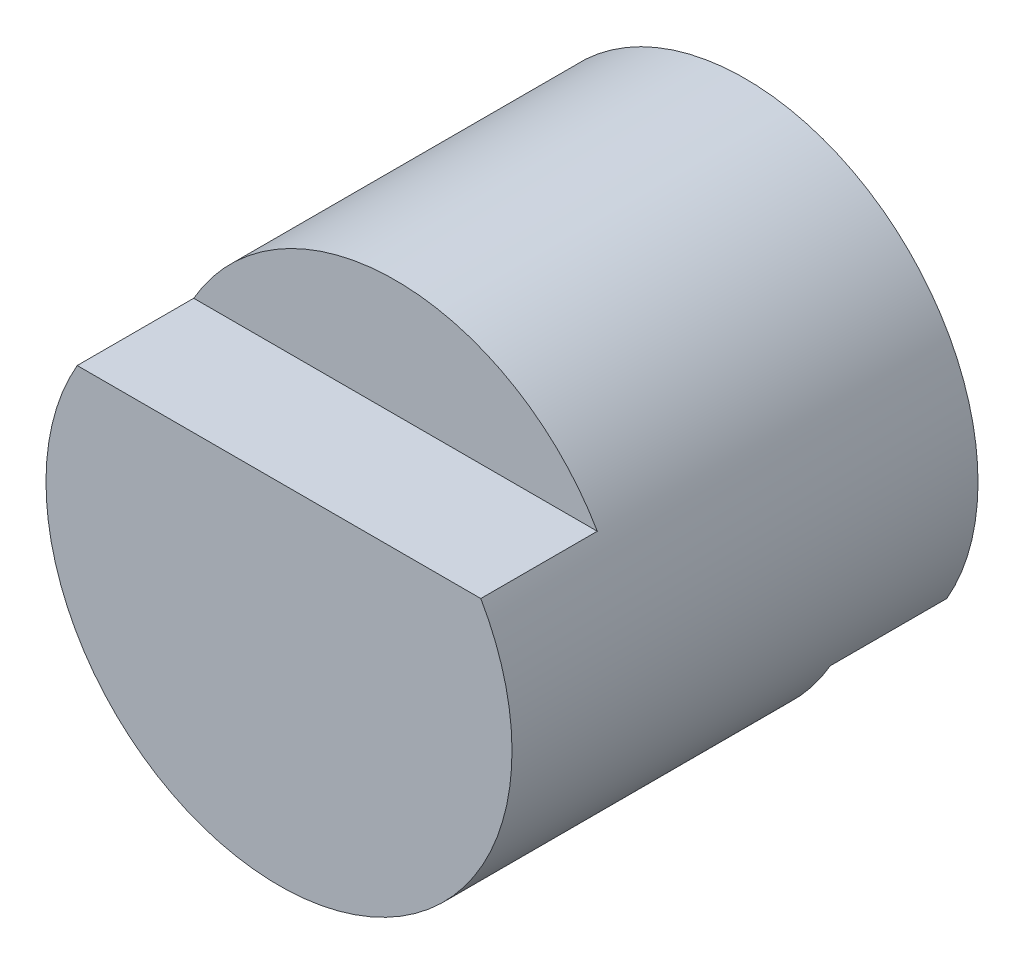
ISO-10303-21;
HEADER;
FILE_DESCRIPTION(('STEP AP214'),'2;1');
FILE_NAME('part.step','',(''),(''),'','','');
FILE_SCHEMA(('AUTOMOTIVE_DESIGN { 1 0 10303 214 1 1 1 1 }'));
ENDSEC;
DATA;
#1=APPLICATION_CONTEXT('core data for automotive mechanical design processes');
#2=APPLICATION_PROTOCOL_DEFINITION('international standard','automotive_design',2000,#1);
#3=PRODUCT_CONTEXT('',#1,'mechanical');
#4=PRODUCT('Part','Part','',(#3));
#5=PRODUCT_RELATED_PRODUCT_CATEGORY('part','',(#4));
#6=PRODUCT_DEFINITION_FORMATION('','',#4);
#7=PRODUCT_DEFINITION_CONTEXT('part definition',#1,'design');
#8=PRODUCT_DEFINITION('design','',#6,#7);
#9=PRODUCT_DEFINITION_SHAPE('','',#8);
#10=(LENGTH_UNIT() NAMED_UNIT(*) SI_UNIT(.MILLI.,.METRE.));
#11=(NAMED_UNIT(*) PLANE_ANGLE_UNIT() SI_UNIT($,.RADIAN.));
#12=(NAMED_UNIT(*) SI_UNIT($,.STERADIAN.) SOLID_ANGLE_UNIT());
#13=UNCERTAINTY_MEASURE_WITH_UNIT(LENGTH_MEASURE(1.E-05),#10,'distance_accuracy_value','');
#14=(GEOMETRIC_REPRESENTATION_CONTEXT(3) GLOBAL_UNCERTAINTY_ASSIGNED_CONTEXT((#13)) GLOBAL_UNIT_ASSIGNED_CONTEXT((#10,
#11,#12)) REPRESENTATION_CONTEXT('',''));
#15=CARTESIAN_POINT('',(0.,0.,0.));
#16=DIRECTION('',(0.,0.,1.));
#17=DIRECTION('',(1.,0.,0.));
#18=AXIS2_PLACEMENT_3D('',#15,#16,#17);
#19=CARTESIAN_POINT('',(0.,0.,4.));
#20=DIRECTION('',(0.,0.,-1.));
#21=DIRECTION('',(-1.,0.,0.));
#22=AXIS2_PLACEMENT_3D('',#19,#20,#21);
#23=CYLINDRICAL_SURFACE('',#22,2.);
#24=CARTESIAN_POINT('',(0.,0.,4.));
#25=DIRECTION('',(0.,0.,1.));
#26=DIRECTION('',(1.,0.,0.));
#27=AXIS2_PLACEMENT_3D('',#24,#25,#26);
#28=CIRCLE('',#27,2.);
#29=CARTESIAN_POINT('',(-1.73205080756888,1.,4.));
#30=VERTEX_POINT('',#29);
#31=CARTESIAN_POINT('',(1.73205080756888,1.,4.));
#32=VERTEX_POINT('',#31);
#33=EDGE_CURVE('E11',#30,#32,#28,.T.);
#34=ORIENTED_EDGE('',*,*,#33,.F.);
#35=DIRECTION('',(0.,0.,1.));
#36=VECTOR('',#35,1.);
#37=CARTESIAN_POINT('',(-1.73205080756888,1.,3.));
#38=LINE('',#37,#36);
#39=CARTESIAN_POINT('',(-1.73205080756888,1.,3.));
#40=VERTEX_POINT('',#39);
#41=EDGE_CURVE('E55',#40,#30,#38,.T.);
#42=ORIENTED_EDGE('',*,*,#41,.F.);
#43=CARTESIAN_POINT('',(0.,0.,3.));
#44=DIRECTION('',(0.,0.,1.));
#45=DIRECTION('',(-1.,0.,0.));
#46=AXIS2_PLACEMENT_3D('',#43,#44,#45);
#47=CIRCLE('',#46,2.);
#48=CARTESIAN_POINT('',(1.73205080756888,1.,3.));
#49=VERTEX_POINT('',#48);
#50=EDGE_CURVE('E92',#49,#40,#47,.T.);
#51=ORIENTED_EDGE('',*,*,#50,.F.);
#52=DIRECTION('',(0.,0.,1.));
#53=VECTOR('',#52,1.);
#54=CARTESIAN_POINT('',(1.73205080756888,1.,3.));
#55=LINE('',#54,#53);
#56=EDGE_CURVE('E98',#49,#32,#55,.T.);
#57=ORIENTED_EDGE('',*,*,#56,.T.);
#58=EDGE_LOOP('',(#34,#42,#51,#57));
#59=FACE_BOUND('',#58,.T.);
#60=CARTESIAN_POINT('',(0.,0.,1.));
#61=DIRECTION('',(0.,0.,-1.));
#62=DIRECTION('',(-1.,0.,0.));
#63=AXIS2_PLACEMENT_3D('',#60,#61,#62);
#64=CIRCLE('',#63,2.);
#65=CARTESIAN_POINT('',(1.73205080756888,-1.,1.));
#66=VERTEX_POINT('',#65);
#67=CARTESIAN_POINT('',(-1.73205080756888,-1.,1.));
#68=VERTEX_POINT('',#67);
#69=EDGE_CURVE('E75',#66,#68,#64,.T.);
#70=ORIENTED_EDGE('',*,*,#69,.F.);
#71=DIRECTION('',(0.,0.,-1.));
#72=VECTOR('',#71,1.);
#73=CARTESIAN_POINT('',(1.73205080756888,-1.,1.));
#74=LINE('',#73,#72);
#75=CARTESIAN_POINT('',(1.73205080756888,-1.,0.));
#76=VERTEX_POINT('',#75);
#77=EDGE_CURVE('E83',#66,#76,#74,.T.);
#78=ORIENTED_EDGE('',*,*,#77,.T.);
#79=CARTESIAN_POINT('',(0.,0.,0.));
#80=DIRECTION('',(0.,0.,1.));
#81=DIRECTION('',(1.,0.,0.));
#82=AXIS2_PLACEMENT_3D('',#79,#80,#81);
#83=CIRCLE('',#82,2.);
#84=CARTESIAN_POINT('',(-1.73205080756888,-1.,0.));
#85=VERTEX_POINT('',#84);
#86=EDGE_CURVE('E36',#76,#85,#83,.T.);
#87=ORIENTED_EDGE('',*,*,#86,.T.);
#88=DIRECTION('',(0.,0.,-1.));
#89=VECTOR('',#88,1.);
#90=CARTESIAN_POINT('',(-1.73205080756888,-1.,1.));
#91=LINE('',#90,#89);
#92=EDGE_CURVE('E47',#68,#85,#91,.T.);
#93=ORIENTED_EDGE('',*,*,#92,.F.);
#94=EDGE_LOOP('',(#70,#78,#87,#93));
#95=FACE_BOUND('',#94,.T.);
#96=ADVANCED_FACE('F33',(#59,#95),#23,.T.);
#97=CARTESIAN_POINT('',(0.,0.,4.));
#98=DIRECTION('',(0.,0.,1.));
#99=DIRECTION('',(1.,0.,0.));
#100=AXIS2_PLACEMENT_3D('',#97,#98,#99);
#101=PLANE('',#100);
#102=DIRECTION('',(1.,0.,0.));
#103=VECTOR('',#102,1.);
#104=CARTESIAN_POINT('',(-1.73205080756888,1.,4.));
#105=LINE('',#104,#103);
#106=EDGE_CURVE('E88',#30,#32,#105,.T.);
#107=ORIENTED_EDGE('',*,*,#106,.F.);
#108=ORIENTED_EDGE('',*,*,#33,.T.);
#109=EDGE_LOOP('',(#107,#108));
#110=FACE_BOUND('',#109,.T.);
#111=ADVANCED_FACE('F105',(#110),#101,.T.);
#112=CARTESIAN_POINT('',(0.,0.,0.));
#113=DIRECTION('',(0.,0.,1.));
#114=DIRECTION('',(1.,0.,0.));
#115=AXIS2_PLACEMENT_3D('',#112,#113,#114);
#116=PLANE('',#115);
#117=ORIENTED_EDGE('',*,*,#86,.F.);
#118=DIRECTION('',(1.,0.,0.));
#119=VECTOR('',#118,1.);
#120=CARTESIAN_POINT('',(1.73205080756888,-1.,0.));
#121=LINE('',#120,#119);
#122=EDGE_CURVE('E80',#85,#76,#121,.T.);
#123=ORIENTED_EDGE('',*,*,#122,.F.);
#124=EDGE_LOOP('',(#117,#123));
#125=FACE_BOUND('',#124,.T.);
#126=ADVANCED_FACE('F109',(#125),#116,.F.);
#127=CARTESIAN_POINT('',(-1.73205080756888,1.,3.));
#128=DIRECTION('',(0.,-1.,0.));
#129=DIRECTION('',(0.,0.,-1.));
#130=AXIS2_PLACEMENT_3D('',#127,#128,#129);
#131=PLANE('',#130);
#132=ORIENTED_EDGE('',*,*,#106,.T.);
#133=ORIENTED_EDGE('',*,*,#56,.F.);
#134=DIRECTION('',(1.,0.,0.));
#135=VECTOR('',#134,1.);
#136=CARTESIAN_POINT('',(-1.73205080756888,1.,3.));
#137=LINE('',#136,#135);
#138=EDGE_CURVE('E94',#40,#49,#137,.T.);
#139=ORIENTED_EDGE('',*,*,#138,.F.);
#140=ORIENTED_EDGE('',*,*,#41,.T.);
#141=EDGE_LOOP('',(#132,#133,#139,#140));
#142=FACE_BOUND('',#141,.T.);
#143=ADVANCED_FACE('F106',(#142),#131,.F.);
#144=CARTESIAN_POINT('',(0.,0.,3.));
#145=DIRECTION('',(0.,0.,-1.));
#146=DIRECTION('',(-1.,0.,0.));
#147=AXIS2_PLACEMENT_3D('',#144,#145,#146);
#148=PLANE('',#147);
#149=ORIENTED_EDGE('',*,*,#50,.T.);
#150=ORIENTED_EDGE('',*,*,#138,.T.);
#151=EDGE_LOOP('',(#149,#150));
#152=FACE_BOUND('',#151,.T.);
#153=ADVANCED_FACE('F108',(#152),#148,.F.);
#154=CARTESIAN_POINT('',(1.73205080756888,-1.,1.));
#155=DIRECTION('',(0.,1.,0.));
#156=DIRECTION('',(0.,0.,1.));
#157=AXIS2_PLACEMENT_3D('',#154,#155,#156);
#158=PLANE('',#157);
#159=ORIENTED_EDGE('',*,*,#122,.T.);
#160=ORIENTED_EDGE('',*,*,#77,.F.);
#161=DIRECTION('',(1.,0.,0.));
#162=VECTOR('',#161,1.);
#163=CARTESIAN_POINT('',(1.73205080756888,-1.,1.));
#164=LINE('',#163,#162);
#165=EDGE_CURVE('E77',#68,#66,#164,.T.);
#166=ORIENTED_EDGE('',*,*,#165,.F.);
#167=ORIENTED_EDGE('',*,*,#92,.T.);
#168=EDGE_LOOP('',(#159,#160,#166,#167));
#169=FACE_BOUND('',#168,.T.);
#170=ADVANCED_FACE('F82',(#169),#158,.F.);
#171=CARTESIAN_POINT('',(0.,0.,1.));
#172=DIRECTION('',(0.,0.,-1.));
#173=DIRECTION('',(-1.,0.,0.));
#174=AXIS2_PLACEMENT_3D('',#171,#172,#173);
#175=PLANE('',#174);
#176=ORIENTED_EDGE('',*,*,#69,.T.);
#177=ORIENTED_EDGE('',*,*,#165,.T.);
#178=EDGE_LOOP('',(#176,#177));
#179=FACE_BOUND('',#178,.T.);
#180=ADVANCED_FACE('F76',(#179),#175,.T.);
#181=CLOSED_SHELL('',(#96,#111,#126,#143,#153,#170,#180));
#182=MANIFOLD_SOLID_BREP('B2',#181);
#183=ADVANCED_BREP_SHAPE_REPRESENTATION('',(#18,#182),#14);
#184=SHAPE_DEFINITION_REPRESENTATION(#9,#183);
ENDSEC;
END-ISO-10303-21;
